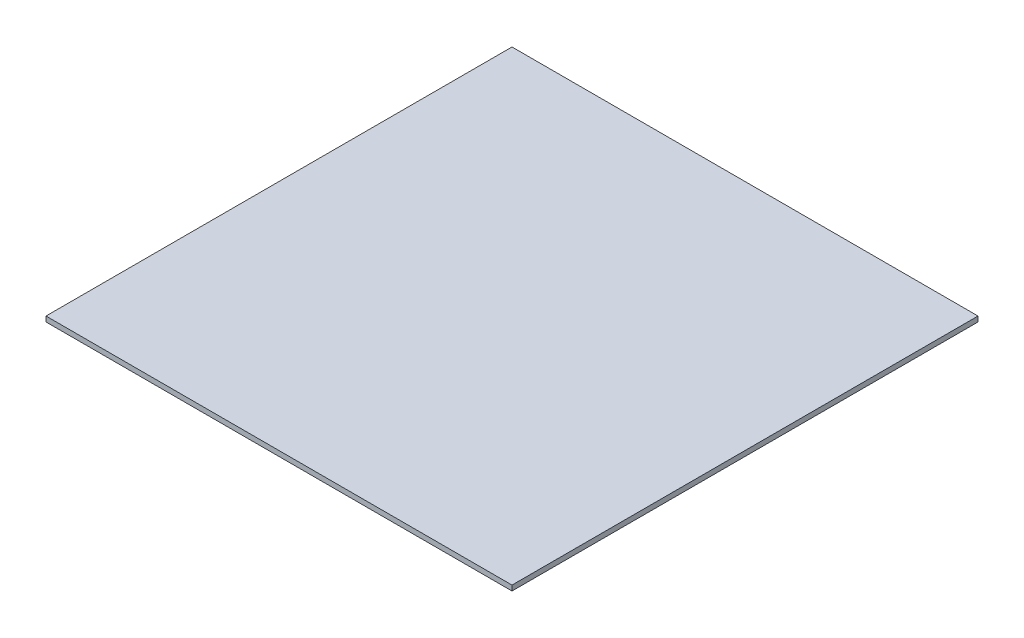
ISO-10303-21;
HEADER;
FILE_DESCRIPTION(('STEP AP214'),'2;1');
FILE_NAME('part.step','',(''),(''),'','','');
FILE_SCHEMA(('AUTOMOTIVE_DESIGN { 1 0 10303 214 1 1 1 1 }'));
ENDSEC;
DATA;
#1=APPLICATION_CONTEXT('core data for automotive mechanical design processes');
#2=APPLICATION_PROTOCOL_DEFINITION('international standard','automotive_design',2000,#1);
#3=PRODUCT_CONTEXT('',#1,'mechanical');
#4=PRODUCT('Part','Part','',(#3));
#5=PRODUCT_RELATED_PRODUCT_CATEGORY('part','',(#4));
#6=PRODUCT_DEFINITION_FORMATION('','',#4);
#7=PRODUCT_DEFINITION_CONTEXT('part definition',#1,'design');
#8=PRODUCT_DEFINITION('design','',#6,#7);
#9=PRODUCT_DEFINITION_SHAPE('','',#8);
#10=(LENGTH_UNIT() NAMED_UNIT(*) SI_UNIT(.MILLI.,.METRE.));
#11=(NAMED_UNIT(*) PLANE_ANGLE_UNIT() SI_UNIT($,.RADIAN.));
#12=(NAMED_UNIT(*) SI_UNIT($,.STERADIAN.) SOLID_ANGLE_UNIT());
#13=UNCERTAINTY_MEASURE_WITH_UNIT(LENGTH_MEASURE(1.E-05),#10,'distance_accuracy_value','');
#14=(GEOMETRIC_REPRESENTATION_CONTEXT(3) GLOBAL_UNCERTAINTY_ASSIGNED_CONTEXT((#13)) GLOBAL_UNIT_ASSIGNED_CONTEXT((#10,
#11,#12)) REPRESENTATION_CONTEXT('',''));
#15=CARTESIAN_POINT('',(0.,0.,0.));
#16=DIRECTION('',(0.,0.,1.));
#17=DIRECTION('',(1.,0.,0.));
#18=AXIS2_PLACEMENT_3D('',#15,#16,#17);
#19=CARTESIAN_POINT('',(135.,3.,-135.));
#20=DIRECTION('',(-1.,0.,0.));
#21=DIRECTION('',(0.,0.,1.));
#22=AXIS2_PLACEMENT_3D('',#19,#20,#21);
#23=PLANE('',#22);
#24=DIRECTION('',(0.,0.,-1.));
#25=VECTOR('',#24,1.);
#26=CARTESIAN_POINT('',(135.,0.,-135.));
#27=LINE('',#26,#25);
#28=CARTESIAN_POINT('',(135.,0.,135.));
#29=VERTEX_POINT('',#28);
#30=CARTESIAN_POINT('',(135.,0.,-135.));
#31=VERTEX_POINT('',#30);
#32=EDGE_CURVE('E99',#29,#31,#27,.T.);
#33=ORIENTED_EDGE('',*,*,#32,.T.);
#34=DIRECTION('',(0.,-1.,0.));
#35=VECTOR('',#34,1.);
#36=CARTESIAN_POINT('',(135.,3.,-135.));
#37=LINE('',#36,#35);
#38=CARTESIAN_POINT('',(135.,3.,-135.));
#39=VERTEX_POINT('',#38);
#40=EDGE_CURVE('E11',#39,#31,#37,.T.);
#41=ORIENTED_EDGE('',*,*,#40,.F.);
#42=DIRECTION('',(0.,0.,-1.));
#43=VECTOR('',#42,1.);
#44=CARTESIAN_POINT('',(135.,3.,-135.));
#45=LINE('',#44,#43);
#46=CARTESIAN_POINT('',(135.,3.,135.));
#47=VERTEX_POINT('',#46);
#48=EDGE_CURVE('E87',#47,#39,#45,.T.);
#49=ORIENTED_EDGE('',*,*,#48,.F.);
#50=DIRECTION('',(0.,-1.,0.));
#51=VECTOR('',#50,1.);
#52=CARTESIAN_POINT('',(135.,3.,135.));
#53=LINE('',#52,#51);
#54=EDGE_CURVE('E95',#47,#29,#53,.T.);
#55=ORIENTED_EDGE('',*,*,#54,.T.);
#56=EDGE_LOOP('',(#33,#41,#49,#55));
#57=FACE_BOUND('',#56,.T.);
#58=ADVANCED_FACE('F36',(#57),#23,.F.);
#59=CARTESIAN_POINT('',(-135.,3.,-135.));
#60=DIRECTION('',(0.,0.,1.));
#61=DIRECTION('',(1.,0.,0.));
#62=AXIS2_PLACEMENT_3D('',#59,#60,#61);
#63=PLANE('',#62);
#64=DIRECTION('',(-1.,0.,0.));
#65=VECTOR('',#64,1.);
#66=CARTESIAN_POINT('',(-135.,0.,-135.));
#67=LINE('',#66,#65);
#68=CARTESIAN_POINT('',(-135.,0.,-135.));
#69=VERTEX_POINT('',#68);
#70=EDGE_CURVE('E91',#31,#69,#67,.T.);
#71=ORIENTED_EDGE('',*,*,#70,.T.);
#72=DIRECTION('',(0.,-1.,0.));
#73=VECTOR('',#72,1.);
#74=CARTESIAN_POINT('',(-135.,3.,-135.));
#75=LINE('',#74,#73);
#76=CARTESIAN_POINT('',(-135.,3.,-135.));
#77=VERTEX_POINT('',#76);
#78=EDGE_CURVE('E44',#77,#69,#75,.T.);
#79=ORIENTED_EDGE('',*,*,#78,.F.);
#80=DIRECTION('',(-1.,0.,0.));
#81=VECTOR('',#80,1.);
#82=CARTESIAN_POINT('',(-135.,3.,-135.));
#83=LINE('',#82,#81);
#84=EDGE_CURVE('E82',#39,#77,#83,.T.);
#85=ORIENTED_EDGE('',*,*,#84,.F.);
#86=ORIENTED_EDGE('',*,*,#40,.T.);
#87=EDGE_LOOP('',(#71,#79,#85,#86));
#88=FACE_BOUND('',#87,.T.);
#89=ADVANCED_FACE('F90',(#88),#63,.F.);
#90=CARTESIAN_POINT('',(-135.,3.,-135.));
#91=DIRECTION('',(1.,0.,0.));
#92=DIRECTION('',(0.,0.,-1.));
#93=AXIS2_PLACEMENT_3D('',#90,#91,#92);
#94=PLANE('',#93);
#95=DIRECTION('',(0.,0.,1.));
#96=VECTOR('',#95,1.);
#97=CARTESIAN_POINT('',(-135.,0.,-135.));
#98=LINE('',#97,#96);
#99=CARTESIAN_POINT('',(-135.,0.,135.));
#100=VERTEX_POINT('',#99);
#101=EDGE_CURVE('E69',#69,#100,#98,.T.);
#102=ORIENTED_EDGE('',*,*,#101,.T.);
#103=DIRECTION('',(0.,-1.,0.));
#104=VECTOR('',#103,1.);
#105=CARTESIAN_POINT('',(-135.,3.,135.));
#106=LINE('',#105,#104);
#107=CARTESIAN_POINT('',(-135.,3.,135.));
#108=VERTEX_POINT('',#107);
#109=EDGE_CURVE('E92',#108,#100,#106,.T.);
#110=ORIENTED_EDGE('',*,*,#109,.F.);
#111=DIRECTION('',(0.,0.,1.));
#112=VECTOR('',#111,1.);
#113=CARTESIAN_POINT('',(-135.,3.,-135.));
#114=LINE('',#113,#112);
#115=EDGE_CURVE('E85',#77,#108,#114,.T.);
#116=ORIENTED_EDGE('',*,*,#115,.F.);
#117=ORIENTED_EDGE('',*,*,#78,.T.);
#118=EDGE_LOOP('',(#102,#110,#116,#117));
#119=FACE_BOUND('',#118,.T.);
#120=ADVANCED_FACE('F93',(#119),#94,.F.);
#121=CARTESIAN_POINT('',(-135.,3.,135.));
#122=DIRECTION('',(0.,0.,-1.));
#123=DIRECTION('',(-1.,0.,0.));
#124=AXIS2_PLACEMENT_3D('',#121,#122,#123);
#125=PLANE('',#124);
#126=DIRECTION('',(1.,0.,0.));
#127=VECTOR('',#126,1.);
#128=CARTESIAN_POINT('',(-135.,0.,135.));
#129=LINE('',#128,#127);
#130=EDGE_CURVE('E75',#100,#29,#129,.T.);
#131=ORIENTED_EDGE('',*,*,#130,.T.);
#132=ORIENTED_EDGE('',*,*,#54,.F.);
#133=DIRECTION('',(1.,0.,0.));
#134=VECTOR('',#133,1.);
#135=CARTESIAN_POINT('',(-135.,3.,135.));
#136=LINE('',#135,#134);
#137=EDGE_CURVE('E52',#108,#47,#136,.T.);
#138=ORIENTED_EDGE('',*,*,#137,.F.);
#139=ORIENTED_EDGE('',*,*,#109,.T.);
#140=EDGE_LOOP('',(#131,#132,#138,#139));
#141=FACE_BOUND('',#140,.T.);
#142=ADVANCED_FACE('F106',(#141),#125,.F.);
#143=CARTESIAN_POINT('',(0.,3.,0.));
#144=DIRECTION('',(0.,1.,0.));
#145=DIRECTION('',(0.,0.,1.));
#146=AXIS2_PLACEMENT_3D('',#143,#144,#145);
#147=PLANE('',#146);
#148=ORIENTED_EDGE('',*,*,#48,.T.);
#149=ORIENTED_EDGE('',*,*,#84,.T.);
#150=ORIENTED_EDGE('',*,*,#115,.T.);
#151=ORIENTED_EDGE('',*,*,#137,.T.);
#152=EDGE_LOOP('',(#148,#149,#150,#151));
#153=FACE_BOUND('',#152,.T.);
#154=ADVANCED_FACE('F83',(#153),#147,.T.);
#155=CARTESIAN_POINT('',(0.,0.,0.));
#156=DIRECTION('',(0.,1.,0.));
#157=DIRECTION('',(0.,0.,1.));
#158=AXIS2_PLACEMENT_3D('',#155,#156,#157);
#159=PLANE('',#158);
#160=ORIENTED_EDGE('',*,*,#32,.F.);
#161=ORIENTED_EDGE('',*,*,#130,.F.);
#162=ORIENTED_EDGE('',*,*,#101,.F.);
#163=ORIENTED_EDGE('',*,*,#70,.F.);
#164=EDGE_LOOP('',(#160,#161,#162,#163));
#165=FACE_BOUND('',#164,.T.);
#166=ADVANCED_FACE('F109',(#165),#159,.F.);
#167=CLOSED_SHELL('',(#58,#89,#120,#142,#154,#166));
#168=MANIFOLD_SOLID_BREP('B2',#167);
#169=ADVANCED_BREP_SHAPE_REPRESENTATION('',(#18,#168),#14);
#170=SHAPE_DEFINITION_REPRESENTATION(#9,#169);
ENDSEC;
END-ISO-10303-21;
